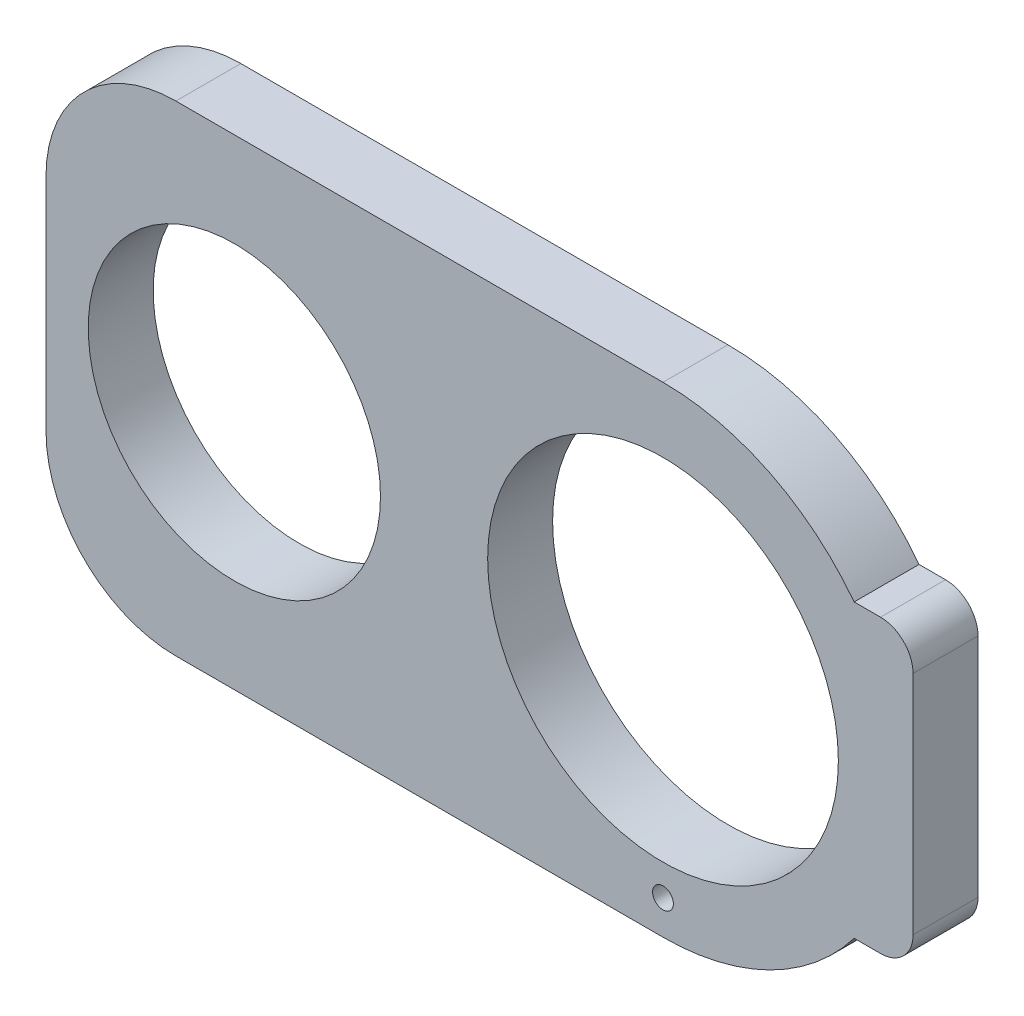
ISO-10303-21;
HEADER;
FILE_DESCRIPTION(('STEP AP214'),'2;1');
FILE_NAME('part.step','',(''),(''),'','','');
FILE_SCHEMA(('AUTOMOTIVE_DESIGN { 1 0 10303 214 1 1 1 1 }'));
ENDSEC;
DATA;
#1=APPLICATION_CONTEXT('core data for automotive mechanical design processes');
#2=APPLICATION_PROTOCOL_DEFINITION('international standard','automotive_design',2000,#1);
#3=PRODUCT_CONTEXT('',#1,'mechanical');
#4=PRODUCT('Part','Part','',(#3));
#5=PRODUCT_RELATED_PRODUCT_CATEGORY('part','',(#4));
#6=PRODUCT_DEFINITION_FORMATION('','',#4);
#7=PRODUCT_DEFINITION_CONTEXT('part definition',#1,'design');
#8=PRODUCT_DEFINITION('design','',#6,#7);
#9=PRODUCT_DEFINITION_SHAPE('','',#8);
#10=(LENGTH_UNIT() NAMED_UNIT(*) SI_UNIT(.MILLI.,.METRE.));
#11=(NAMED_UNIT(*) PLANE_ANGLE_UNIT() SI_UNIT($,.RADIAN.));
#12=(NAMED_UNIT(*) SI_UNIT($,.STERADIAN.) SOLID_ANGLE_UNIT());
#13=UNCERTAINTY_MEASURE_WITH_UNIT(LENGTH_MEASURE(1.E-05),#10,'distance_accuracy_value','');
#14=(GEOMETRIC_REPRESENTATION_CONTEXT(3) GLOBAL_UNCERTAINTY_ASSIGNED_CONTEXT((#13)) GLOBAL_UNIT_ASSIGNED_CONTEXT((#10,
#11,#12)) REPRESENTATION_CONTEXT('',''));
#15=CARTESIAN_POINT('',(0.,0.,0.));
#16=DIRECTION('',(0.,0.,1.));
#17=DIRECTION('',(1.,0.,0.));
#18=AXIS2_PLACEMENT_3D('',#15,#16,#17);
#19=CARTESIAN_POINT('',(-48.0929771354812,-170.645932850951,-10.));
#20=DIRECTION('',(0.,0.,1.));
#21=DIRECTION('',(1.,0.,0.));
#22=AXIS2_PLACEMENT_3D('',#19,#20,#21);
#23=CYLINDRICAL_SURFACE('',#22,36.9999999999998);
#24=CARTESIAN_POINT('',(-48.0929771354812,-170.645932850951,0.));
#25=DIRECTION('',(0.,0.,1.));
#26=DIRECTION('',(1.,0.,0.));
#27=AXIS2_PLACEMENT_3D('',#24,#25,#26);
#28=CIRCLE('',#27,36.9999999999998);
#29=CARTESIAN_POINT('',(-48.0929771354812,-207.645932850951,0.));
#30=VERTEX_POINT('',#29);
#31=CARTESIAN_POINT('',(-18.6641916193409,-193.072403439186,0.));
#32=VERTEX_POINT('',#31);
#33=EDGE_CURVE('E157',#30,#32,#28,.T.);
#34=ORIENTED_EDGE('',*,*,#33,.F.);
#35=DIRECTION('',(0.,0.,1.));
#36=VECTOR('',#35,1.);
#37=CARTESIAN_POINT('',(-48.0929771354812,-207.645932850951,-10.));
#38=LINE('',#37,#36);
#39=CARTESIAN_POINT('',(-48.0929771354812,-207.645932850951,-10.));
#40=VERTEX_POINT('',#39);
#41=EDGE_CURVE('E11',#40,#30,#38,.T.);
#42=ORIENTED_EDGE('',*,*,#41,.F.);
#43=CARTESIAN_POINT('',(-48.0929771354812,-170.645932850951,-10.));
#44=DIRECTION('',(0.,0.,1.));
#45=DIRECTION('',(1.,0.,0.));
#46=AXIS2_PLACEMENT_3D('',#43,#44,#45);
#47=CIRCLE('',#46,36.9999999999998);
#48=CARTESIAN_POINT('',(-18.6641916193409,-193.072403439186,-10.));
#49=VERTEX_POINT('',#48);
#50=EDGE_CURVE('E190',#40,#49,#47,.T.);
#51=ORIENTED_EDGE('',*,*,#50,.T.);
#52=DIRECTION('',(0.,0.,1.));
#53=VECTOR('',#52,1.);
#54=CARTESIAN_POINT('',(-18.6641916193409,-193.072403439186,-10.));
#55=LINE('',#54,#53);
#56=EDGE_CURVE('E39',#49,#32,#55,.T.);
#57=ORIENTED_EDGE('',*,*,#56,.T.);
#58=EDGE_LOOP('',(#34,#42,#51,#57));
#59=FACE_BOUND('',#58,.T.);
#60=ADVANCED_FACE('F36',(#59),#23,.T.);
#61=CARTESIAN_POINT('',(-48.0929771354812,-207.645932850951,-10.));
#62=DIRECTION('',(0.,-1.,0.));
#63=DIRECTION('',(0.,0.,-1.));
#64=AXIS2_PLACEMENT_3D('',#61,#62,#63);
#65=PLANE('',#64);
#66=DIRECTION('',(1.,0.,0.));
#67=VECTOR('',#66,1.);
#68=CARTESIAN_POINT('',(-48.0929771354812,-207.645932850951,0.));
#69=LINE('',#68,#67);
#70=CARTESIAN_POINT('',(-123.092977135481,-207.645932850951,0.));
#71=VERTEX_POINT('',#70);
#72=EDGE_CURVE('E188',#71,#30,#69,.T.);
#73=ORIENTED_EDGE('',*,*,#72,.F.);
#74=DIRECTION('',(0.,0.,1.));
#75=VECTOR('',#74,1.);
#76=CARTESIAN_POINT('',(-123.092977135481,-207.645932850951,-10.));
#77=LINE('',#76,#75);
#78=CARTESIAN_POINT('',(-123.092977135481,-207.645932850951,-10.));
#79=VERTEX_POINT('',#78);
#80=EDGE_CURVE('E45',#79,#71,#77,.T.);
#81=ORIENTED_EDGE('',*,*,#80,.F.);
#82=DIRECTION('',(1.,0.,0.));
#83=VECTOR('',#82,1.);
#84=CARTESIAN_POINT('',(-48.0929771354812,-207.645932850951,-10.));
#85=LINE('',#84,#83);
#86=EDGE_CURVE('E147',#79,#40,#85,.T.);
#87=ORIENTED_EDGE('',*,*,#86,.T.);
#88=ORIENTED_EDGE('',*,*,#41,.T.);
#89=EDGE_LOOP('',(#73,#81,#87,#88));
#90=FACE_BOUND('',#89,.T.);
#91=ADVANCED_FACE('F210',(#90),#65,.T.);
#92=CARTESIAN_POINT('',(-123.092977135482,-187.645932850951,-10.));
#93=DIRECTION('',(0.,0.,1.));
#94=DIRECTION('',(1.,0.,0.));
#95=AXIS2_PLACEMENT_3D('',#92,#93,#94);
#96=CYLINDRICAL_SURFACE('',#95,20.);
#97=CARTESIAN_POINT('',(-123.092977135482,-187.645932850951,0.));
#98=DIRECTION('',(0.,0.,1.));
#99=DIRECTION('',(-1.,0.,0.));
#100=AXIS2_PLACEMENT_3D('',#97,#98,#99);
#101=CIRCLE('',#100,20.);
#102=CARTESIAN_POINT('',(-143.092977135482,-187.645932850951,0.));
#103=VERTEX_POINT('',#102);
#104=EDGE_CURVE('E134',#103,#71,#101,.T.);
#105=ORIENTED_EDGE('',*,*,#104,.F.);
#106=DIRECTION('',(0.,0.,1.));
#107=VECTOR('',#106,1.);
#108=CARTESIAN_POINT('',(-143.092977135482,-187.645932850951,-10.));
#109=LINE('',#108,#107);
#110=CARTESIAN_POINT('',(-143.092977135482,-187.645932850951,-10.));
#111=VERTEX_POINT('',#110);
#112=EDGE_CURVE('E129',#111,#103,#109,.T.);
#113=ORIENTED_EDGE('',*,*,#112,.F.);
#114=CARTESIAN_POINT('',(-123.092977135482,-187.645932850951,-10.));
#115=DIRECTION('',(0.,0.,1.));
#116=DIRECTION('',(-1.,0.,0.));
#117=AXIS2_PLACEMENT_3D('',#114,#115,#116);
#118=CIRCLE('',#117,20.);
#119=EDGE_CURVE('E132',#111,#79,#118,.T.);
#120=ORIENTED_EDGE('',*,*,#119,.T.);
#121=ORIENTED_EDGE('',*,*,#80,.T.);
#122=EDGE_LOOP('',(#105,#113,#120,#121));
#123=FACE_BOUND('',#122,.T.);
#124=ADVANCED_FACE('F131',(#123),#96,.T.);
#125=CARTESIAN_POINT('',(-143.092977135482,-187.64593285095,-10.));
#126=DIRECTION('',(-1.,0.,0.));
#127=DIRECTION('',(0.,0.,1.));
#128=AXIS2_PLACEMENT_3D('',#125,#126,#127);
#129=PLANE('',#128);
#130=DIRECTION('',(0.,-1.,0.));
#131=VECTOR('',#130,1.);
#132=CARTESIAN_POINT('',(-143.092977135482,-187.64593285095,0.));
#133=LINE('',#132,#131);
#134=CARTESIAN_POINT('',(-143.092977135482,-153.645932850951,0.));
#135=VERTEX_POINT('',#134);
#136=EDGE_CURVE('E185',#135,#103,#133,.T.);
#137=ORIENTED_EDGE('',*,*,#136,.F.);
#138=DIRECTION('',(0.,0.,1.));
#139=VECTOR('',#138,1.);
#140=CARTESIAN_POINT('',(-143.092977135482,-153.645932850951,-10.));
#141=LINE('',#140,#139);
#142=CARTESIAN_POINT('',(-143.092977135482,-153.645932850951,-10.));
#143=VERTEX_POINT('',#142);
#144=EDGE_CURVE('E139',#143,#135,#141,.T.);
#145=ORIENTED_EDGE('',*,*,#144,.F.);
#146=DIRECTION('',(0.,-1.,0.));
#147=VECTOR('',#146,1.);
#148=CARTESIAN_POINT('',(-143.092977135482,-187.64593285095,-10.));
#149=LINE('',#148,#147);
#150=EDGE_CURVE('E145',#143,#111,#149,.T.);
#151=ORIENTED_EDGE('',*,*,#150,.T.);
#152=ORIENTED_EDGE('',*,*,#112,.T.);
#153=EDGE_LOOP('',(#137,#145,#151,#152));
#154=FACE_BOUND('',#153,.T.);
#155=ADVANCED_FACE('F149',(#154),#129,.T.);
#156=CARTESIAN_POINT('',(-123.092977135482,-153.645932850951,-10.));
#157=DIRECTION('',(0.,0.,1.));
#158=DIRECTION('',(1.,0.,0.));
#159=AXIS2_PLACEMENT_3D('',#156,#157,#158);
#160=CYLINDRICAL_SURFACE('',#159,20.);
#161=CARTESIAN_POINT('',(-123.092977135482,-153.645932850951,0.));
#162=DIRECTION('',(0.,0.,1.));
#163=DIRECTION('',(1.,0.,0.));
#164=AXIS2_PLACEMENT_3D('',#161,#162,#163);
#165=CIRCLE('',#164,20.);
#166=CARTESIAN_POINT('',(-123.092977135481,-133.645932850951,0.));
#167=VERTEX_POINT('',#166);
#168=EDGE_CURVE('E182',#167,#135,#165,.T.);
#169=ORIENTED_EDGE('',*,*,#168,.F.);
#170=DIRECTION('',(0.,0.,1.));
#171=VECTOR('',#170,1.);
#172=CARTESIAN_POINT('',(-123.092977135481,-133.645932850951,-10.));
#173=LINE('',#172,#171);
#174=CARTESIAN_POINT('',(-123.092977135481,-133.645932850951,-10.));
#175=VERTEX_POINT('',#174);
#176=EDGE_CURVE('E194',#175,#167,#173,.T.);
#177=ORIENTED_EDGE('',*,*,#176,.F.);
#178=CARTESIAN_POINT('',(-123.092977135482,-153.645932850951,-10.));
#179=DIRECTION('',(0.,0.,1.));
#180=DIRECTION('',(1.,0.,0.));
#181=AXIS2_PLACEMENT_3D('',#178,#179,#180);
#182=CIRCLE('',#181,20.);
#183=EDGE_CURVE('E150',#175,#143,#182,.T.);
#184=ORIENTED_EDGE('',*,*,#183,.T.);
#185=ORIENTED_EDGE('',*,*,#144,.T.);
#186=EDGE_LOOP('',(#169,#177,#184,#185));
#187=FACE_BOUND('',#186,.T.);
#188=ADVANCED_FACE('F223',(#187),#160,.T.);
#189=CARTESIAN_POINT('',(-48.0929771354812,-133.645932850951,-10.));
#190=DIRECTION('',(0.,1.,0.));
#191=DIRECTION('',(0.,0.,1.));
#192=AXIS2_PLACEMENT_3D('',#189,#190,#191);
#193=PLANE('',#192);
#194=DIRECTION('',(-1.,0.,0.));
#195=VECTOR('',#194,1.);
#196=CARTESIAN_POINT('',(-48.0929771354812,-133.645932850951,0.));
#197=LINE('',#196,#195);
#198=CARTESIAN_POINT('',(-48.0929771354812,-133.645932850951,0.));
#199=VERTEX_POINT('',#198);
#200=EDGE_CURVE('E179',#199,#167,#197,.T.);
#201=ORIENTED_EDGE('',*,*,#200,.F.);
#202=DIRECTION('',(0.,0.,1.));
#203=VECTOR('',#202,1.);
#204=CARTESIAN_POINT('',(-48.0929771354812,-133.645932850951,-10.));
#205=LINE('',#204,#203);
#206=CARTESIAN_POINT('',(-48.0929771354812,-133.645932850951,-10.));
#207=VERTEX_POINT('',#206);
#208=EDGE_CURVE('E196',#207,#199,#205,.T.);
#209=ORIENTED_EDGE('',*,*,#208,.F.);
#210=DIRECTION('',(-1.,0.,0.));
#211=VECTOR('',#210,1.);
#212=CARTESIAN_POINT('',(-48.0929771354812,-133.645932850951,-10.));
#213=LINE('',#212,#211);
#214=EDGE_CURVE('E152',#207,#175,#213,.T.);
#215=ORIENTED_EDGE('',*,*,#214,.T.);
#216=ORIENTED_EDGE('',*,*,#176,.T.);
#217=EDGE_LOOP('',(#201,#209,#215,#216));
#218=FACE_BOUND('',#217,.T.);
#219=ADVANCED_FACE('F226',(#218),#193,.T.);
#220=CARTESIAN_POINT('',(-48.0929771354812,-170.645932850951,-10.));
#221=DIRECTION('',(0.,0.,1.));
#222=DIRECTION('',(1.,0.,0.));
#223=AXIS2_PLACEMENT_3D('',#220,#221,#222);
#224=CYLINDRICAL_SURFACE('',#223,36.9999999999998);
#225=CARTESIAN_POINT('',(-48.0929771354812,-170.645932850951,0.));
#226=DIRECTION('',(0.,0.,1.));
#227=DIRECTION('',(1.,0.,0.));
#228=AXIS2_PLACEMENT_3D('',#225,#226,#227);
#229=CIRCLE('',#228,36.9999999999998);
#230=CARTESIAN_POINT('',(-18.6641916193407,-148.219462262715,0.));
#231=VERTEX_POINT('',#230);
#232=EDGE_CURVE('E176',#231,#199,#229,.T.);
#233=ORIENTED_EDGE('',*,*,#232,.F.);
#234=DIRECTION('',(0.,0.,1.));
#235=VECTOR('',#234,1.);
#236=CARTESIAN_POINT('',(-18.6641916193407,-148.219462262715,-10.));
#237=LINE('',#236,#235);
#238=CARTESIAN_POINT('',(-18.6641916193407,-148.219462262715,-10.));
#239=VERTEX_POINT('',#238);
#240=EDGE_CURVE('E198',#239,#231,#237,.T.);
#241=ORIENTED_EDGE('',*,*,#240,.F.);
#242=CARTESIAN_POINT('',(-48.0929771354812,-170.645932850951,-10.));
#243=DIRECTION('',(0.,0.,1.));
#244=DIRECTION('',(1.,0.,0.));
#245=AXIS2_PLACEMENT_3D('',#242,#243,#244);
#246=CIRCLE('',#245,36.9999999999998);
#247=EDGE_CURVE('E310',#239,#207,#246,.T.);
#248=ORIENTED_EDGE('',*,*,#247,.T.);
#249=ORIENTED_EDGE('',*,*,#208,.T.);
#250=EDGE_LOOP('',(#233,#241,#248,#249));
#251=FACE_BOUND('',#250,.T.);
#252=ADVANCED_FACE('F230',(#251),#224,.T.);
#253=CARTESIAN_POINT('',(-14.5929771354816,-148.219462262715,-10.));
#254=DIRECTION('',(0.,1.,0.));
#255=DIRECTION('',(0.,0.,1.));
#256=AXIS2_PLACEMENT_3D('',#253,#254,#255);
#257=PLANE('',#256);
#258=DIRECTION('',(-1.,0.,0.));
#259=VECTOR('',#258,1.);
#260=CARTESIAN_POINT('',(-14.5929771354816,-148.219462262715,0.));
#261=LINE('',#260,#259);
#262=CARTESIAN_POINT('',(-14.5929771354816,-148.219462262715,0.));
#263=VERTEX_POINT('',#262);
#264=EDGE_CURVE('E173',#263,#231,#261,.T.);
#265=ORIENTED_EDGE('',*,*,#264,.F.);
#266=DIRECTION('',(0.,0.,1.));
#267=VECTOR('',#266,1.);
#268=CARTESIAN_POINT('',(-14.5929771354816,-148.219462262715,-10.));
#269=LINE('',#268,#267);
#270=CARTESIAN_POINT('',(-14.5929771354816,-148.219462262715,-10.));
#271=VERTEX_POINT('',#270);
#272=EDGE_CURVE('E200',#271,#263,#269,.T.);
#273=ORIENTED_EDGE('',*,*,#272,.F.);
#274=DIRECTION('',(-1.,0.,0.));
#275=VECTOR('',#274,1.);
#276=CARTESIAN_POINT('',(-14.5929771354816,-148.219462262715,-10.));
#277=LINE('',#276,#275);
#278=EDGE_CURVE('E307',#271,#239,#277,.T.);
#279=ORIENTED_EDGE('',*,*,#278,.T.);
#280=ORIENTED_EDGE('',*,*,#240,.T.);
#281=EDGE_LOOP('',(#265,#273,#279,#280));
#282=FACE_BOUND('',#281,.T.);
#283=ADVANCED_FACE('F234',(#282),#257,.T.);
#284=CARTESIAN_POINT('',(-14.5929771354816,-153.219462262715,-10.));
#285=DIRECTION('',(0.,0.,1.));
#286=DIRECTION('',(1.,0.,0.));
#287=AXIS2_PLACEMENT_3D('',#284,#285,#286);
#288=CYLINDRICAL_SURFACE('',#287,5.);
#289=CARTESIAN_POINT('',(-14.5929771354816,-153.219462262715,0.));
#290=DIRECTION('',(0.,0.,1.));
#291=DIRECTION('',(1.,0.,0.));
#292=AXIS2_PLACEMENT_3D('',#289,#290,#291);
#293=CIRCLE('',#292,5.);
#294=CARTESIAN_POINT('',(-9.59297713548165,-153.219462262715,0.));
#295=VERTEX_POINT('',#294);
#296=EDGE_CURVE('E170',#295,#263,#293,.T.);
#297=ORIENTED_EDGE('',*,*,#296,.F.);
#298=DIRECTION('',(0.,0.,1.));
#299=VECTOR('',#298,1.);
#300=CARTESIAN_POINT('',(-9.59297713548165,-153.219462262715,-10.));
#301=LINE('',#300,#299);
#302=CARTESIAN_POINT('',(-9.59297713548165,-153.219462262715,-10.));
#303=VERTEX_POINT('',#302);
#304=EDGE_CURVE('E202',#303,#295,#301,.T.);
#305=ORIENTED_EDGE('',*,*,#304,.F.);
#306=CARTESIAN_POINT('',(-14.5929771354816,-153.219462262715,-10.));
#307=DIRECTION('',(0.,0.,1.));
#308=DIRECTION('',(1.,0.,0.));
#309=AXIS2_PLACEMENT_3D('',#306,#307,#308);
#310=CIRCLE('',#309,5.);
#311=EDGE_CURVE('E304',#303,#271,#310,.T.);
#312=ORIENTED_EDGE('',*,*,#311,.T.);
#313=ORIENTED_EDGE('',*,*,#272,.T.);
#314=EDGE_LOOP('',(#297,#305,#312,#313));
#315=FACE_BOUND('',#314,.T.);
#316=ADVANCED_FACE('F238',(#315),#288,.T.);
#317=CARTESIAN_POINT('',(-9.59297713548164,-188.072403439186,-10.));
#318=DIRECTION('',(1.,0.,0.));
#319=DIRECTION('',(0.,1.,0.));
#320=AXIS2_PLACEMENT_3D('',#317,#318,#319);
#321=PLANE('',#320);
#322=DIRECTION('',(0.,1.,0.));
#323=VECTOR('',#322,1.);
#324=CARTESIAN_POINT('',(-9.59297713548164,-188.072403439186,0.));
#325=LINE('',#324,#323);
#326=CARTESIAN_POINT('',(-9.59297713548164,-188.072403439186,0.));
#327=VERTEX_POINT('',#326);
#328=EDGE_CURVE('E167',#327,#295,#325,.T.);
#329=ORIENTED_EDGE('',*,*,#328,.F.);
#330=DIRECTION('',(0.,0.,1.));
#331=VECTOR('',#330,1.);
#332=CARTESIAN_POINT('',(-9.59297713548164,-188.072403439186,-10.));
#333=LINE('',#332,#331);
#334=CARTESIAN_POINT('',(-9.59297713548164,-188.072403439186,-10.));
#335=VERTEX_POINT('',#334);
#336=EDGE_CURVE('E204',#335,#327,#333,.T.);
#337=ORIENTED_EDGE('',*,*,#336,.F.);
#338=DIRECTION('',(0.,1.,0.));
#339=VECTOR('',#338,1.);
#340=CARTESIAN_POINT('',(-9.59297713548164,-188.072403439186,-10.));
#341=LINE('',#340,#339);
#342=EDGE_CURVE('E301',#335,#303,#341,.T.);
#343=ORIENTED_EDGE('',*,*,#342,.T.);
#344=ORIENTED_EDGE('',*,*,#304,.T.);
#345=EDGE_LOOP('',(#329,#337,#343,#344));
#346=FACE_BOUND('',#345,.T.);
#347=ADVANCED_FACE('F242',(#346),#321,.T.);
#348=CARTESIAN_POINT('',(-14.5929771354816,-188.072403439186,-10.));
#349=DIRECTION('',(0.,0.,1.));
#350=DIRECTION('',(1.,0.,0.));
#351=AXIS2_PLACEMENT_3D('',#348,#349,#350);
#352=CYLINDRICAL_SURFACE('',#351,5.);
#353=CARTESIAN_POINT('',(-14.5929771354816,-188.072403439186,0.));
#354=DIRECTION('',(0.,0.,1.));
#355=DIRECTION('',(1.,0.,0.));
#356=AXIS2_PLACEMENT_3D('',#353,#354,#355);
#357=CIRCLE('',#356,5.);
#358=CARTESIAN_POINT('',(-14.5929771354816,-193.072403439186,0.));
#359=VERTEX_POINT('',#358);
#360=EDGE_CURVE('E164',#359,#327,#357,.T.);
#361=ORIENTED_EDGE('',*,*,#360,.F.);
#362=DIRECTION('',(0.,0.,1.));
#363=VECTOR('',#362,1.);
#364=CARTESIAN_POINT('',(-14.5929771354816,-193.072403439186,-10.));
#365=LINE('',#364,#363);
#366=CARTESIAN_POINT('',(-14.5929771354816,-193.072403439186,-10.));
#367=VERTEX_POINT('',#366);
#368=EDGE_CURVE('E205',#367,#359,#365,.T.);
#369=ORIENTED_EDGE('',*,*,#368,.F.);
#370=CARTESIAN_POINT('',(-14.5929771354816,-188.072403439186,-10.));
#371=DIRECTION('',(0.,0.,1.));
#372=DIRECTION('',(1.,0.,0.));
#373=AXIS2_PLACEMENT_3D('',#370,#371,#372);
#374=CIRCLE('',#373,5.);
#375=EDGE_CURVE('E298',#367,#335,#374,.T.);
#376=ORIENTED_EDGE('',*,*,#375,.T.);
#377=ORIENTED_EDGE('',*,*,#336,.T.);
#378=EDGE_LOOP('',(#361,#369,#376,#377));
#379=FACE_BOUND('',#378,.T.);
#380=ADVANCED_FACE('F246',(#379),#352,.T.);
#381=CARTESIAN_POINT('',(-18.6641916193409,-193.072403439186,-10.));
#382=DIRECTION('',(0.,-1.,0.));
#383=DIRECTION('',(0.,0.,-1.));
#384=AXIS2_PLACEMENT_3D('',#381,#382,#383);
#385=PLANE('',#384);
#386=DIRECTION('',(1.,0.,0.));
#387=VECTOR('',#386,1.);
#388=CARTESIAN_POINT('',(-18.6641916193409,-193.072403439186,0.));
#389=LINE('',#388,#387);
#390=EDGE_CURVE('E160',#32,#359,#389,.T.);
#391=ORIENTED_EDGE('',*,*,#390,.F.);
#392=ORIENTED_EDGE('',*,*,#56,.F.);
#393=DIRECTION('',(1.,0.,0.));
#394=VECTOR('',#393,1.);
#395=CARTESIAN_POINT('',(-18.6641916193409,-193.072403439186,-10.));
#396=LINE('',#395,#394);
#397=EDGE_CURVE('E296',#49,#367,#396,.T.);
#398=ORIENTED_EDGE('',*,*,#397,.T.);
#399=ORIENTED_EDGE('',*,*,#368,.T.);
#400=EDGE_LOOP('',(#391,#392,#398,#399));
#401=FACE_BOUND('',#400,.T.);
#402=ADVANCED_FACE('F207',(#401),#385,.T.);
#403=CARTESIAN_POINT('',(-48.0929771354812,-170.645932850951,-10.));
#404=DIRECTION('',(0.,0.,1.));
#405=DIRECTION('',(1.,0.,0.));
#406=AXIS2_PLACEMENT_3D('',#403,#404,#405);
#407=PLANE('',#406);
#408=CARTESIAN_POINT('',(-48.0929771354814,-202.395935058414,-10.));
#409=DIRECTION('',(0.,0.,1.));
#410=DIRECTION('',(1.,0.,0.));
#411=AXIS2_PLACEMENT_3D('',#408,#409,#410);
#412=CIRCLE('',#411,1.6);
#413=CARTESIAN_POINT('',(-46.4929771354814,-202.395935058414,-10.));
#414=VERTEX_POINT('',#413);
#415=EDGE_CURVE('E277',#414,#414,#412,.T.);
#416=ORIENTED_EDGE('',*,*,#415,.T.);
#417=EDGE_LOOP('',(#416));
#418=FACE_BOUND('',#417,.T.);
#419=CARTESIAN_POINT('',(-114.092977135482,-170.645932850951,-10.));
#420=DIRECTION('',(0.,0.,1.));
#421=DIRECTION('',(1.,0.,0.));
#422=AXIS2_PLACEMENT_3D('',#419,#420,#421);
#423=CIRCLE('',#422,22.5);
#424=CARTESIAN_POINT('',(-91.5929771354816,-170.645932850951,-10.));
#425=VERTEX_POINT('',#424);
#426=EDGE_CURVE('E285',#425,#425,#423,.T.);
#427=ORIENTED_EDGE('',*,*,#426,.T.);
#428=EDGE_LOOP('',(#427));
#429=FACE_BOUND('',#428,.T.);
#430=CARTESIAN_POINT('',(-48.0929771354812,-170.645932850951,-10.));
#431=DIRECTION('',(0.,0.,1.));
#432=DIRECTION('',(1.,0.,0.));
#433=AXIS2_PLACEMENT_3D('',#430,#431,#432);
#434=CIRCLE('',#433,26.9999999999996);
#435=CARTESIAN_POINT('',(-21.0929771354816,-170.645932850951,-10.));
#436=VERTEX_POINT('',#435);
#437=EDGE_CURVE('E161',#436,#436,#434,.T.);
#438=ORIENTED_EDGE('',*,*,#437,.T.);
#439=EDGE_LOOP('',(#438));
#440=FACE_BOUND('',#439,.T.);
#441=ORIENTED_EDGE('',*,*,#50,.F.);
#442=ORIENTED_EDGE('',*,*,#86,.F.);
#443=ORIENTED_EDGE('',*,*,#119,.F.);
#444=ORIENTED_EDGE('',*,*,#150,.F.);
#445=ORIENTED_EDGE('',*,*,#183,.F.);
#446=ORIENTED_EDGE('',*,*,#214,.F.);
#447=ORIENTED_EDGE('',*,*,#247,.F.);
#448=ORIENTED_EDGE('',*,*,#278,.F.);
#449=ORIENTED_EDGE('',*,*,#311,.F.);
#450=ORIENTED_EDGE('',*,*,#342,.F.);
#451=ORIENTED_EDGE('',*,*,#375,.F.);
#452=ORIENTED_EDGE('',*,*,#397,.F.);
#453=EDGE_LOOP('',(#441,#442,#443,#444,#445,#446,#447,#448,#449,#450,#451,#452));
#454=FACE_BOUND('',#453,.T.);
#455=ADVANCED_FACE('F143',(#418,#429,#440,#454),#407,.F.);
#456=CARTESIAN_POINT('',(-48.0929771354812,-170.645932850951,0.));
#457=DIRECTION('',(0.,0.,1.));
#458=DIRECTION('',(1.,0.,0.));
#459=AXIS2_PLACEMENT_3D('',#456,#457,#458);
#460=PLANE('',#459);
#461=CARTESIAN_POINT('',(-48.0929771354814,-202.395935058414,0.));
#462=DIRECTION('',(0.,0.,1.));
#463=DIRECTION('',(1.,0.,0.));
#464=AXIS2_PLACEMENT_3D('',#461,#462,#463);
#465=CIRCLE('',#464,1.6);
#466=CARTESIAN_POINT('',(-46.4929771354814,-202.395935058414,0.));
#467=VERTEX_POINT('',#466);
#468=EDGE_CURVE('E280',#467,#467,#465,.T.);
#469=ORIENTED_EDGE('',*,*,#468,.F.);
#470=EDGE_LOOP('',(#469));
#471=FACE_BOUND('',#470,.T.);
#472=CARTESIAN_POINT('',(-114.092977135482,-170.645932850951,0.));
#473=DIRECTION('',(0.,0.,1.));
#474=DIRECTION('',(1.,0.,0.));
#475=AXIS2_PLACEMENT_3D('',#472,#473,#474);
#476=CIRCLE('',#475,22.5);
#477=CARTESIAN_POINT('',(-91.5929771354816,-170.645932850951,0.));
#478=VERTEX_POINT('',#477);
#479=EDGE_CURVE('E282',#478,#478,#476,.T.);
#480=ORIENTED_EDGE('',*,*,#479,.F.);
#481=EDGE_LOOP('',(#480));
#482=FACE_BOUND('',#481,.T.);
#483=CARTESIAN_POINT('',(-48.0929771354812,-170.645932850951,0.));
#484=DIRECTION('',(0.,0.,1.));
#485=DIRECTION('',(1.,0.,0.));
#486=AXIS2_PLACEMENT_3D('',#483,#484,#485);
#487=CIRCLE('',#486,26.9999999999996);
#488=CARTESIAN_POINT('',(-21.0929771354816,-170.645932850951,0.));
#489=VERTEX_POINT('',#488);
#490=EDGE_CURVE('E288',#489,#489,#487,.T.);
#491=ORIENTED_EDGE('',*,*,#490,.F.);
#492=EDGE_LOOP('',(#491));
#493=FACE_BOUND('',#492,.T.);
#494=ORIENTED_EDGE('',*,*,#33,.T.);
#495=ORIENTED_EDGE('',*,*,#390,.T.);
#496=ORIENTED_EDGE('',*,*,#360,.T.);
#497=ORIENTED_EDGE('',*,*,#328,.T.);
#498=ORIENTED_EDGE('',*,*,#296,.T.);
#499=ORIENTED_EDGE('',*,*,#264,.T.);
#500=ORIENTED_EDGE('',*,*,#232,.T.);
#501=ORIENTED_EDGE('',*,*,#200,.T.);
#502=ORIENTED_EDGE('',*,*,#168,.T.);
#503=ORIENTED_EDGE('',*,*,#136,.T.);
#504=ORIENTED_EDGE('',*,*,#104,.T.);
#505=ORIENTED_EDGE('',*,*,#72,.T.);
#506=EDGE_LOOP('',(#494,#495,#496,#497,#498,#499,#500,#501,#502,#503,#504,#505));
#507=FACE_BOUND('',#506,.T.);
#508=ADVANCED_FACE('F209',(#471,#482,#493,#507),#460,.T.);
#509=CARTESIAN_POINT('',(-48.0929771354812,-170.645932850951,-10.));
#510=DIRECTION('',(0.,0.,1.));
#511=DIRECTION('',(1.,0.,0.));
#512=AXIS2_PLACEMENT_3D('',#509,#510,#511);
#513=CYLINDRICAL_SURFACE('',#512,26.9999999999996);
#514=ORIENTED_EDGE('',*,*,#437,.F.);
#515=EDGE_LOOP('',(#514));
#516=FACE_BOUND('',#515,.T.);
#517=ORIENTED_EDGE('',*,*,#490,.T.);
#518=EDGE_LOOP('',(#517));
#519=FACE_BOUND('',#518,.T.);
#520=ADVANCED_FACE('F258',(#516,#519),#513,.F.);
#521=CARTESIAN_POINT('',(-114.092977135482,-170.645932850951,-10.));
#522=DIRECTION('',(0.,0.,1.));
#523=DIRECTION('',(1.,0.,0.));
#524=AXIS2_PLACEMENT_3D('',#521,#522,#523);
#525=CYLINDRICAL_SURFACE('',#524,22.5);
#526=ORIENTED_EDGE('',*,*,#426,.F.);
#527=EDGE_LOOP('',(#526));
#528=FACE_BOUND('',#527,.T.);
#529=ORIENTED_EDGE('',*,*,#479,.T.);
#530=EDGE_LOOP('',(#529));
#531=FACE_BOUND('',#530,.T.);
#532=ADVANCED_FACE('F265',(#528,#531),#525,.F.);
#533=CARTESIAN_POINT('',(-48.0929771354814,-202.395935058414,-10.));
#534=DIRECTION('',(0.,0.,1.));
#535=DIRECTION('',(1.,0.,0.));
#536=AXIS2_PLACEMENT_3D('',#533,#534,#535);
#537=CYLINDRICAL_SURFACE('',#536,1.6);
#538=ORIENTED_EDGE('',*,*,#415,.F.);
#539=EDGE_LOOP('',(#538));
#540=FACE_BOUND('',#539,.T.);
#541=ORIENTED_EDGE('',*,*,#468,.T.);
#542=EDGE_LOOP('',(#541));
#543=FACE_BOUND('',#542,.T.);
#544=ADVANCED_FACE('F269',(#540,#543),#537,.F.);
#545=CLOSED_SHELL('',(#60,#91,#124,#155,#188,#219,#252,#283,#316,#347,#380,#402,#455,#508,#520,
#532,#544));
#546=MANIFOLD_SOLID_BREP('B2',#545);
#547=ADVANCED_BREP_SHAPE_REPRESENTATION('',(#18,#546),#14);
#548=SHAPE_DEFINITION_REPRESENTATION(#9,#547);
ENDSEC;
END-ISO-10303-21;
